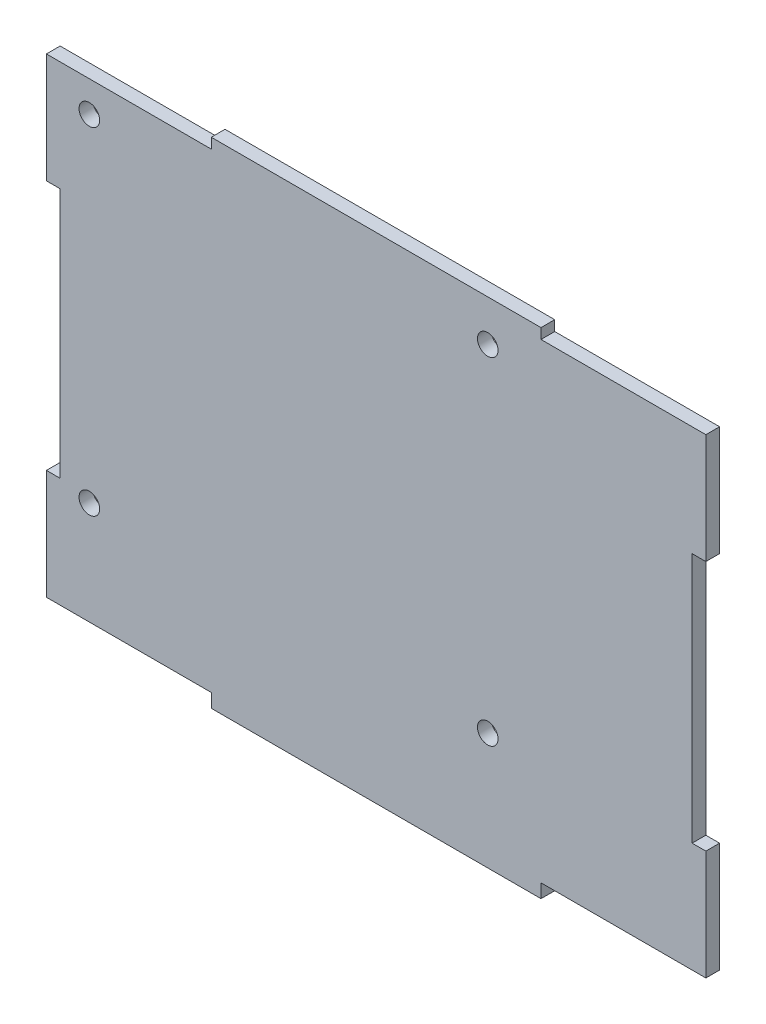
ISO-10303-21;
HEADER;
FILE_DESCRIPTION(('STEP AP214'),'2;1');
FILE_NAME('part.step','',(''),(''),'','','');
FILE_SCHEMA(('AUTOMOTIVE_DESIGN { 1 0 10303 214 1 1 1 1 }'));
ENDSEC;
DATA;
#1=APPLICATION_CONTEXT('core data for automotive mechanical design processes');
#2=APPLICATION_PROTOCOL_DEFINITION('international standard','automotive_design',2000,#1);
#3=PRODUCT_CONTEXT('',#1,'mechanical');
#4=PRODUCT('Part','Part','',(#3));
#5=PRODUCT_RELATED_PRODUCT_CATEGORY('part','',(#4));
#6=PRODUCT_DEFINITION_FORMATION('','',#4);
#7=PRODUCT_DEFINITION_CONTEXT('part definition',#1,'design');
#8=PRODUCT_DEFINITION('design','',#6,#7);
#9=PRODUCT_DEFINITION_SHAPE('','',#8);
#10=(LENGTH_UNIT() NAMED_UNIT(*) SI_UNIT(.MILLI.,.METRE.));
#11=(NAMED_UNIT(*) PLANE_ANGLE_UNIT() SI_UNIT($,.RADIAN.));
#12=(NAMED_UNIT(*) SI_UNIT($,.STERADIAN.) SOLID_ANGLE_UNIT());
#13=UNCERTAINTY_MEASURE_WITH_UNIT(LENGTH_MEASURE(1.E-05),#10,'distance_accuracy_value','');
#14=(GEOMETRIC_REPRESENTATION_CONTEXT(3) GLOBAL_UNCERTAINTY_ASSIGNED_CONTEXT((#13)) GLOBAL_UNIT_ASSIGNED_CONTEXT((#10,
#11,#12)) REPRESENTATION_CONTEXT('',''));
#15=CARTESIAN_POINT('',(0.,0.,0.));
#16=DIRECTION('',(0.,0.,1.));
#17=DIRECTION('',(1.,0.,0.));
#18=AXIS2_PLACEMENT_3D('',#15,#16,#17);
#19=CARTESIAN_POINT('',(50.0272444260496,49.5737704918033,2.));
#20=DIRECTION('',(-1.,0.,0.));
#21=DIRECTION('',(0.,0.,1.));
#22=AXIS2_PLACEMENT_3D('',#19,#20,#21);
#23=PLANE('',#22);
#24=DIRECTION('',(0.,1.,0.));
#25=VECTOR('',#24,1.);
#26=CARTESIAN_POINT('',(50.0272444260496,49.5737704918033,2.));
#27=LINE('',#26,#25);
#28=CARTESIAN_POINT('',(50.0272444260505,32.0737704918033,2.));
#29=VERTEX_POINT('',#28);
#30=CARTESIAN_POINT('',(50.02724442605,48.0737704918033,2.));
#31=VERTEX_POINT('',#30);
#32=EDGE_CURVE('E197',#29,#31,#27,.T.);
#33=ORIENTED_EDGE('',*,*,#32,.F.);
#34=DIRECTION('',(0.,0.,-1.));
#35=VECTOR('',#34,1.);
#36=CARTESIAN_POINT('',(50.0272444260505,32.0737704918033,2.));
#37=LINE('',#36,#35);
#38=CARTESIAN_POINT('',(50.0272444260505,32.0737704918033,0.));
#39=VERTEX_POINT('',#38);
#40=EDGE_CURVE('E334',#29,#39,#37,.T.);
#41=ORIENTED_EDGE('',*,*,#40,.T.);
#42=DIRECTION('',(0.,1.,0.));
#43=VECTOR('',#42,1.);
#44=CARTESIAN_POINT('',(50.0272444260496,49.5737704918033,0.));
#45=LINE('',#44,#43);
#46=CARTESIAN_POINT('',(50.0272444260496,48.0737704918033,0.));
#47=VERTEX_POINT('',#46);
#48=EDGE_CURVE('E212',#39,#47,#45,.T.);
#49=ORIENTED_EDGE('',*,*,#48,.T.);
#50=DIRECTION('',(0.,0.,-1.));
#51=VECTOR('',#50,1.);
#52=CARTESIAN_POINT('',(50.02724442605,48.0737704918033,2.));
#53=LINE('',#52,#51);
#54=EDGE_CURVE('E288',#31,#47,#53,.T.);
#55=ORIENTED_EDGE('',*,*,#54,.F.);
#56=EDGE_LOOP('',(#33,#41,#49,#55));
#57=FACE_BOUND('',#56,.T.);
#58=ADVANCED_FACE('F33',(#57),#23,.F.);
#59=CARTESIAN_POINT('',(-45.9727555739504,49.5737704918033,2.));
#60=DIRECTION('',(1.,0.,0.));
#61=DIRECTION('',(0.,1.,0.));
#62=AXIS2_PLACEMENT_3D('',#59,#60,#61);
#63=PLANE('',#62);
#64=DIRECTION('',(0.,-1.,0.));
#65=VECTOR('',#64,1.);
#66=CARTESIAN_POINT('',(-45.9727555739504,49.5737704918033,2.));
#67=LINE('',#66,#65);
#68=CARTESIAN_POINT('',(-45.9727555739495,-4.4262295081967,2.));
#69=VERTEX_POINT('',#68);
#70=CARTESIAN_POINT('',(-45.9727555739504,-20.4262295081967,2.));
#71=VERTEX_POINT('',#70);
#72=EDGE_CURVE('E215',#69,#71,#67,.T.);
#73=ORIENTED_EDGE('',*,*,#72,.F.);
#74=DIRECTION('',(0.,0.,-1.));
#75=VECTOR('',#74,1.);
#76=CARTESIAN_POINT('',(-45.9727555739495,-4.4262295081967,2.));
#77=LINE('',#76,#75);
#78=CARTESIAN_POINT('',(-45.9727555739495,-4.4262295081967,0.));
#79=VERTEX_POINT('',#78);
#80=EDGE_CURVE('E301',#69,#79,#77,.T.);
#81=ORIENTED_EDGE('',*,*,#80,.T.);
#82=DIRECTION('',(0.,-1.,0.));
#83=VECTOR('',#82,1.);
#84=CARTESIAN_POINT('',(-45.9727555739504,49.5737704918033,0.));
#85=LINE('',#84,#83);
#86=CARTESIAN_POINT('',(-45.9727555739504,-20.4262295081967,0.));
#87=VERTEX_POINT('',#86);
#88=EDGE_CURVE('E209',#79,#87,#85,.T.);
#89=ORIENTED_EDGE('',*,*,#88,.T.);
#90=DIRECTION('',(0.,0.,-1.));
#91=VECTOR('',#90,1.);
#92=CARTESIAN_POINT('',(-45.9727555739504,-20.4262295081967,2.));
#93=LINE('',#92,#91);
#94=EDGE_CURVE('E268',#71,#87,#93,.T.);
#95=ORIENTED_EDGE('',*,*,#94,.F.);
#96=EDGE_LOOP('',(#73,#81,#89,#95));
#97=FACE_BOUND('',#96,.T.);
#98=ADVANCED_FACE('F395',(#97),#63,.F.);
#99=CARTESIAN_POINT('',(-45.97275557395,48.0737704918033,0.));
#100=VERTEX_POINT('',#99);
#101=CARTESIAN_POINT('',(-45.9727555739504,32.0737704918033,0.));
#102=VERTEX_POINT('',#101);
#103=EDGE_CURVE('E205',#100,#102,#85,.T.);
#104=ORIENTED_EDGE('',*,*,#103,.T.);
#105=DIRECTION('',(0.,0.,-1.));
#106=VECTOR('',#105,1.);
#107=CARTESIAN_POINT('',(-45.9727555739495,32.0737704918033,2.));
#108=LINE('',#107,#106);
#109=CARTESIAN_POINT('',(-45.9727555739495,32.0737704918033,2.));
#110=VERTEX_POINT('',#109);
#111=EDGE_CURVE('E56',#110,#102,#108,.T.);
#112=ORIENTED_EDGE('',*,*,#111,.F.);
#113=CARTESIAN_POINT('',(-45.97275557395,48.0737704918033,2.));
#114=VERTEX_POINT('',#113);
#115=EDGE_CURVE('E220',#114,#110,#67,.T.);
#116=ORIENTED_EDGE('',*,*,#115,.F.);
#117=DIRECTION('',(0.,0.,-1.));
#118=VECTOR('',#117,1.);
#119=CARTESIAN_POINT('',(-45.97275557395,48.0737704918033,2.));
#120=LINE('',#119,#118);
#121=EDGE_CURVE('E287',#114,#100,#120,.T.);
#122=ORIENTED_EDGE('',*,*,#121,.T.);
#123=EDGE_LOOP('',(#104,#112,#116,#122));
#124=FACE_BOUND('',#123,.T.);
#125=ADVANCED_FACE('F35',(#124),#63,.F.);
#126=CARTESIAN_POINT('',(-45.9727555739504,-22.4262295081967,2.));
#127=DIRECTION('',(0.,1.,0.));
#128=DIRECTION('',(0.,0.,1.));
#129=AXIS2_PLACEMENT_3D('',#126,#127,#128);
#130=PLANE('',#129);
#131=DIRECTION('',(1.,0.,0.));
#132=VECTOR('',#131,1.);
#133=CARTESIAN_POINT('',(-45.9727555739504,-22.4262295081967,2.));
#134=LINE('',#133,#132);
#135=CARTESIAN_POINT('',(-21.9727555739504,-22.4262295081967,2.));
#136=VERTEX_POINT('',#135);
#137=CARTESIAN_POINT('',(26.0272444260496,-22.4262295081967,2.));
#138=VERTEX_POINT('',#137);
#139=EDGE_CURVE('E201',#136,#138,#134,.T.);
#140=ORIENTED_EDGE('',*,*,#139,.F.);
#141=DIRECTION('',(0.,0.,-1.));
#142=VECTOR('',#141,1.);
#143=CARTESIAN_POINT('',(-21.9727555739504,-22.4262295081967,2.));
#144=LINE('',#143,#142);
#145=CARTESIAN_POINT('',(-21.9727555739504,-22.4262295081967,0.));
#146=VERTEX_POINT('',#145);
#147=EDGE_CURVE('E249',#136,#146,#144,.T.);
#148=ORIENTED_EDGE('',*,*,#147,.T.);
#149=DIRECTION('',(1.,0.,0.));
#150=VECTOR('',#149,1.);
#151=CARTESIAN_POINT('',(-45.9727555739504,-22.4262295081967,0.));
#152=LINE('',#151,#150);
#153=CARTESIAN_POINT('',(26.0272444260496,-22.4262295081967,0.));
#154=VERTEX_POINT('',#153);
#155=EDGE_CURVE('E208',#146,#154,#152,.T.);
#156=ORIENTED_EDGE('',*,*,#155,.T.);
#157=DIRECTION('',(0.,0.,-1.));
#158=VECTOR('',#157,1.);
#159=CARTESIAN_POINT('',(26.0272444260496,-22.4262295081967,2.));
#160=LINE('',#159,#158);
#161=EDGE_CURVE('E252',#138,#154,#160,.T.);
#162=ORIENTED_EDGE('',*,*,#161,.F.);
#163=EDGE_LOOP('',(#140,#148,#156,#162));
#164=FACE_BOUND('',#163,.T.);
#165=ADVANCED_FACE('F408',(#164),#130,.F.);
#166=CARTESIAN_POINT('',(50.0272444260496,-20.4262295081967,0.));
#167=VERTEX_POINT('',#166);
#168=CARTESIAN_POINT('',(50.0272444260496,-4.4262295081967,0.));
#169=VERTEX_POINT('',#168);
#170=EDGE_CURVE('E187',#167,#169,#45,.T.);
#171=ORIENTED_EDGE('',*,*,#170,.T.);
#172=DIRECTION('',(0.,0.,-1.));
#173=VECTOR('',#172,1.);
#174=CARTESIAN_POINT('',(50.0272444260505,-4.4262295081967,2.));
#175=LINE('',#174,#173);
#176=CARTESIAN_POINT('',(50.0272444260505,-4.4262295081967,2.));
#177=VERTEX_POINT('',#176);
#178=EDGE_CURVE('E48',#177,#169,#175,.T.);
#179=ORIENTED_EDGE('',*,*,#178,.F.);
#180=CARTESIAN_POINT('',(50.0272444260496,-20.4262295081967,2.));
#181=VERTEX_POINT('',#180);
#182=EDGE_CURVE('E185',#181,#177,#27,.T.);
#183=ORIENTED_EDGE('',*,*,#182,.F.);
#184=DIRECTION('',(0.,0.,-1.));
#185=VECTOR('',#184,1.);
#186=CARTESIAN_POINT('',(50.0272444260496,-20.4262295081967,2.));
#187=LINE('',#186,#185);
#188=EDGE_CURVE('E256',#181,#167,#187,.T.);
#189=ORIENTED_EDGE('',*,*,#188,.T.);
#190=EDGE_LOOP('',(#171,#179,#183,#189));
#191=FACE_BOUND('',#190,.T.);
#192=ADVANCED_FACE('F183',(#191),#23,.F.);
#193=CARTESIAN_POINT('',(-45.9727555739504,49.5737704918033,2.));
#194=DIRECTION('',(0.,-1.,0.));
#195=DIRECTION('',(0.,0.,-1.));
#196=AXIS2_PLACEMENT_3D('',#193,#194,#195);
#197=PLANE('',#196);
#198=DIRECTION('',(-1.,0.,0.));
#199=VECTOR('',#198,1.);
#200=CARTESIAN_POINT('',(-45.9727555739504,49.5737704918033,0.));
#201=LINE('',#200,#199);
#202=CARTESIAN_POINT('',(26.02724442605,49.5737704918033,0.));
#203=VERTEX_POINT('',#202);
#204=CARTESIAN_POINT('',(-21.97275557395,49.5737704918033,0.));
#205=VERTEX_POINT('',#204);
#206=EDGE_CURVE('E213',#203,#205,#201,.T.);
#207=ORIENTED_EDGE('',*,*,#206,.T.);
#208=DIRECTION('',(0.,0.,1.));
#209=VECTOR('',#208,1.);
#210=CARTESIAN_POINT('',(-21.97275557395,49.5737704918033,2.));
#211=LINE('',#210,#209);
#212=CARTESIAN_POINT('',(-21.97275557395,49.5737704918033,2.));
#213=VERTEX_POINT('',#212);
#214=EDGE_CURVE('E265',#205,#213,#211,.T.);
#215=ORIENTED_EDGE('',*,*,#214,.T.);
#216=DIRECTION('',(-1.,0.,0.));
#217=VECTOR('',#216,1.);
#218=CARTESIAN_POINT('',(-45.9727555739504,49.5737704918033,2.));
#219=LINE('',#218,#217);
#220=CARTESIAN_POINT('',(26.02724442605,49.5737704918033,2.));
#221=VERTEX_POINT('',#220);
#222=EDGE_CURVE('E41',#221,#213,#219,.T.);
#223=ORIENTED_EDGE('',*,*,#222,.F.);
#224=DIRECTION('',(0.,0.,-1.));
#225=VECTOR('',#224,1.);
#226=CARTESIAN_POINT('',(26.02724442605,49.5737704918033,2.));
#227=LINE('',#226,#225);
#228=EDGE_CURVE('E285',#221,#203,#227,.T.);
#229=ORIENTED_EDGE('',*,*,#228,.T.);
#230=EDGE_LOOP('',(#207,#215,#223,#229));
#231=FACE_BOUND('',#230,.T.);
#232=ADVANCED_FACE('F374',(#231),#197,.F.);
#233=CARTESIAN_POINT('',(0.,0.,2.));
#234=DIRECTION('',(0.,0.,1.));
#235=DIRECTION('',(1.,0.,0.));
#236=AXIS2_PLACEMENT_3D('',#233,#234,#235);
#237=PLANE('',#236);
#238=DIRECTION('',(1.,0.,0.));
#239=VECTOR('',#238,1.);
#240=CARTESIAN_POINT('',(50.0272444260505,32.0737704918033,2.));
#241=LINE('',#240,#239);
#242=CARTESIAN_POINT('',(48.0272444260505,32.0737704918033,2.));
#243=VERTEX_POINT('',#242);
#244=EDGE_CURVE('E188',#243,#29,#241,.T.);
#245=ORIENTED_EDGE('',*,*,#244,.T.);
#246=ORIENTED_EDGE('',*,*,#32,.T.);
#247=DIRECTION('',(-1.,0.,0.));
#248=VECTOR('',#247,1.);
#249=CARTESIAN_POINT('',(50.02724442605,48.0737704918033,2.));
#250=LINE('',#249,#248);
#251=CARTESIAN_POINT('',(26.02724442605,48.0737704918033,2.));
#252=VERTEX_POINT('',#251);
#253=EDGE_CURVE('E297',#31,#252,#250,.T.);
#254=ORIENTED_EDGE('',*,*,#253,.T.);
#255=DIRECTION('',(0.,1.,0.));
#256=VECTOR('',#255,1.);
#257=CARTESIAN_POINT('',(26.02724442605,50.0737704918033,2.));
#258=LINE('',#257,#256);
#259=EDGE_CURVE('E292',#252,#221,#258,.T.);
#260=ORIENTED_EDGE('',*,*,#259,.T.);
#261=ORIENTED_EDGE('',*,*,#222,.T.);
#262=DIRECTION('',(0.,-1.,0.));
#263=VECTOR('',#262,1.);
#264=CARTESIAN_POINT('',(-21.97275557395,50.0737704918033,2.));
#265=LINE('',#264,#263);
#266=CARTESIAN_POINT('',(-21.97275557395,48.0737704918033,2.));
#267=VERTEX_POINT('',#266);
#268=EDGE_CURVE('E313',#213,#267,#265,.T.);
#269=ORIENTED_EDGE('',*,*,#268,.T.);
#270=DIRECTION('',(-1.,0.,0.));
#271=VECTOR('',#270,1.);
#272=CARTESIAN_POINT('',(-45.97275557395,48.0737704918033,2.));
#273=LINE('',#272,#271);
#274=EDGE_CURVE('E309',#267,#114,#273,.T.);
#275=ORIENTED_EDGE('',*,*,#274,.T.);
#276=ORIENTED_EDGE('',*,*,#115,.T.);
#277=DIRECTION('',(1.,0.,0.));
#278=VECTOR('',#277,1.);
#279=CARTESIAN_POINT('',(-45.9727555739495,32.0737704918033,2.));
#280=LINE('',#279,#278);
#281=CARTESIAN_POINT('',(-43.9727555739495,32.0737704918033,2.));
#282=VERTEX_POINT('',#281);
#283=EDGE_CURVE('E328',#110,#282,#280,.T.);
#284=ORIENTED_EDGE('',*,*,#283,.T.);
#285=DIRECTION('',(0.,-1.,0.));
#286=VECTOR('',#285,1.);
#287=CARTESIAN_POINT('',(-43.9727555739495,-4.4262295081967,2.));
#288=LINE('',#287,#286);
#289=CARTESIAN_POINT('',(-43.9727555739495,-4.4262295081967,2.));
#290=VERTEX_POINT('',#289);
#291=EDGE_CURVE('E336',#282,#290,#288,.T.);
#292=ORIENTED_EDGE('',*,*,#291,.T.);
#293=DIRECTION('',(-1.,0.,0.));
#294=VECTOR('',#293,1.);
#295=CARTESIAN_POINT('',(-45.9727555739495,-4.4262295081967,2.));
#296=LINE('',#295,#294);
#297=EDGE_CURVE('E320',#290,#69,#296,.T.);
#298=ORIENTED_EDGE('',*,*,#297,.T.);
#299=ORIENTED_EDGE('',*,*,#72,.T.);
#300=DIRECTION('',(1.,0.,0.));
#301=VECTOR('',#300,1.);
#302=CARTESIAN_POINT('',(-45.9727555739504,-20.4262295081967,2.));
#303=LINE('',#302,#301);
#304=CARTESIAN_POINT('',(-21.9727555739504,-20.4262295081967,2.));
#305=VERTEX_POINT('',#304);
#306=EDGE_CURVE('E278',#71,#305,#303,.T.);
#307=ORIENTED_EDGE('',*,*,#306,.T.);
#308=DIRECTION('',(0.,-1.,0.));
#309=VECTOR('',#308,1.);
#310=CARTESIAN_POINT('',(-21.9727555739504,-22.4262295081967,2.));
#311=LINE('',#310,#309);
#312=EDGE_CURVE('E272',#305,#136,#311,.T.);
#313=ORIENTED_EDGE('',*,*,#312,.T.);
#314=ORIENTED_EDGE('',*,*,#139,.T.);
#315=DIRECTION('',(0.,1.,0.));
#316=VECTOR('',#315,1.);
#317=CARTESIAN_POINT('',(26.0272444260496,-22.4262295081967,2.));
#318=LINE('',#317,#316);
#319=CARTESIAN_POINT('',(26.0272444260496,-20.4262295081967,2.));
#320=VERTEX_POINT('',#319);
#321=EDGE_CURVE('E261',#138,#320,#318,.T.);
#322=ORIENTED_EDGE('',*,*,#321,.T.);
#323=DIRECTION('',(1.,0.,0.));
#324=VECTOR('',#323,1.);
#325=CARTESIAN_POINT('',(50.0272444260496,-20.4262295081967,2.));
#326=LINE('',#325,#324);
#327=EDGE_CURVE('E196',#320,#181,#326,.T.);
#328=ORIENTED_EDGE('',*,*,#327,.T.);
#329=ORIENTED_EDGE('',*,*,#182,.T.);
#330=DIRECTION('',(-1.,0.,0.));
#331=VECTOR('',#330,1.);
#332=CARTESIAN_POINT('',(50.0272444260505,-4.4262295081967,2.));
#333=LINE('',#332,#331);
#334=CARTESIAN_POINT('',(48.0272444260505,-4.4262295081967,2.));
#335=VERTEX_POINT('',#334);
#336=EDGE_CURVE('E170',#177,#335,#333,.T.);
#337=ORIENTED_EDGE('',*,*,#336,.T.);
#338=DIRECTION('',(0.,1.,0.));
#339=VECTOR('',#338,1.);
#340=CARTESIAN_POINT('',(48.0272444260505,-4.4262295081967,2.));
#341=LINE('',#340,#339);
#342=EDGE_CURVE('E177',#335,#243,#341,.T.);
#343=ORIENTED_EDGE('',*,*,#342,.T.);
#344=EDGE_LOOP('',(#245,#246,#254,#260,#261,#269,#275,#276,#284,#292,#298,#299,#307,#313,#314,
#322,#328,#329,#337,#343));
#345=FACE_BOUND('',#344,.T.);
#346=CARTESIAN_POINT('',(18.2772444260498,43.5737704918031,2.));
#347=DIRECTION('',(0.,0.,-1.));
#348=DIRECTION('',(-1.,0.,0.));
#349=AXIS2_PLACEMENT_3D('',#346,#347,#348);
#350=CIRCLE('',#349,1.5);
#351=CARTESIAN_POINT('',(16.7772444260498,43.5737704918031,2.));
#352=VERTEX_POINT('',#351);
#353=EDGE_CURVE('E231',#352,#352,#350,.T.);
#354=ORIENTED_EDGE('',*,*,#353,.T.);
#355=EDGE_LOOP('',(#354));
#356=FACE_BOUND('',#355,.T.);
#357=CARTESIAN_POINT('',(-39.7227555739502,-5.42622950819689,2.));
#358=DIRECTION('',(0.,0.,-1.));
#359=DIRECTION('',(-1.,0.,0.));
#360=AXIS2_PLACEMENT_3D('',#357,#358,#359);
#361=CIRCLE('',#360,1.5);
#362=CARTESIAN_POINT('',(-41.2227555739502,-5.42622950819689,2.));
#363=VERTEX_POINT('',#362);
#364=EDGE_CURVE('E237',#363,#363,#361,.T.);
#365=ORIENTED_EDGE('',*,*,#364,.T.);
#366=EDGE_LOOP('',(#365));
#367=FACE_BOUND('',#366,.T.);
#368=CARTESIAN_POINT('',(-39.7227555739502,43.5737704918031,2.));
#369=DIRECTION('',(0.,0.,-1.));
#370=DIRECTION('',(-1.,0.,0.));
#371=AXIS2_PLACEMENT_3D('',#368,#369,#370);
#372=CIRCLE('',#371,1.5);
#373=CARTESIAN_POINT('',(-41.2227555739502,43.5737704918031,2.));
#374=VERTEX_POINT('',#373);
#375=EDGE_CURVE('E238',#374,#374,#372,.T.);
#376=ORIENTED_EDGE('',*,*,#375,.T.);
#377=EDGE_LOOP('',(#376));
#378=FACE_BOUND('',#377,.T.);
#379=CARTESIAN_POINT('',(18.2772444260498,-5.42622950819689,2.));
#380=DIRECTION('',(0.,0.,-1.));
#381=DIRECTION('',(-1.,0.,0.));
#382=AXIS2_PLACEMENT_3D('',#379,#380,#381);
#383=CIRCLE('',#382,1.5);
#384=CARTESIAN_POINT('',(16.7772444260498,-5.42622950819689,2.));
#385=VERTEX_POINT('',#384);
#386=EDGE_CURVE('E230',#385,#385,#383,.T.);
#387=ORIENTED_EDGE('',*,*,#386,.T.);
#388=EDGE_LOOP('',(#387));
#389=FACE_BOUND('',#388,.T.);
#390=ADVANCED_FACE('F192',(#345,#356,#367,#378,#389),#237,.T.);
#391=CARTESIAN_POINT('',(0.,0.,0.));
#392=DIRECTION('',(0.,0.,1.));
#393=DIRECTION('',(1.,0.,0.));
#394=AXIS2_PLACEMENT_3D('',#391,#392,#393);
#395=PLANE('',#394);
#396=CARTESIAN_POINT('',(18.2772444260498,43.5737704918031,0.));
#397=DIRECTION('',(0.,0.,-1.));
#398=DIRECTION('',(-1.,0.,0.));
#399=AXIS2_PLACEMENT_3D('',#396,#397,#398);
#400=CIRCLE('',#399,1.5);
#401=CARTESIAN_POINT('',(16.7772444260498,43.5737704918031,0.));
#402=VERTEX_POINT('',#401);
#403=EDGE_CURVE('E241',#402,#402,#400,.T.);
#404=ORIENTED_EDGE('',*,*,#403,.F.);
#405=EDGE_LOOP('',(#404));
#406=FACE_BOUND('',#405,.T.);
#407=CARTESIAN_POINT('',(-39.7227555739502,-5.42622950819689,0.));
#408=DIRECTION('',(0.,0.,-1.));
#409=DIRECTION('',(-1.,0.,0.));
#410=AXIS2_PLACEMENT_3D('',#407,#408,#409);
#411=CIRCLE('',#410,1.5);
#412=CARTESIAN_POINT('',(-41.2227555739502,-5.42622950819689,0.));
#413=VERTEX_POINT('',#412);
#414=EDGE_CURVE('E234',#413,#413,#411,.T.);
#415=ORIENTED_EDGE('',*,*,#414,.F.);
#416=EDGE_LOOP('',(#415));
#417=FACE_BOUND('',#416,.T.);
#418=CARTESIAN_POINT('',(-39.7227555739502,43.5737704918031,0.));
#419=DIRECTION('',(0.,0.,-1.));
#420=DIRECTION('',(-1.,0.,0.));
#421=AXIS2_PLACEMENT_3D('',#418,#419,#420);
#422=CIRCLE('',#421,1.5);
#423=CARTESIAN_POINT('',(-41.2227555739502,43.5737704918031,0.));
#424=VERTEX_POINT('',#423);
#425=EDGE_CURVE('E246',#424,#424,#422,.T.);
#426=ORIENTED_EDGE('',*,*,#425,.F.);
#427=EDGE_LOOP('',(#426));
#428=FACE_BOUND('',#427,.T.);
#429=CARTESIAN_POINT('',(18.2772444260498,-5.42622950819689,0.));
#430=DIRECTION('',(0.,0.,-1.));
#431=DIRECTION('',(-1.,0.,0.));
#432=AXIS2_PLACEMENT_3D('',#429,#430,#431);
#433=CIRCLE('',#432,1.5);
#434=CARTESIAN_POINT('',(16.7772444260498,-5.42622950819689,0.));
#435=VERTEX_POINT('',#434);
#436=EDGE_CURVE('E227',#435,#435,#433,.T.);
#437=ORIENTED_EDGE('',*,*,#436,.F.);
#438=EDGE_LOOP('',(#437));
#439=FACE_BOUND('',#438,.T.);
#440=ORIENTED_EDGE('',*,*,#48,.F.);
#441=DIRECTION('',(1.,0.,0.));
#442=VECTOR('',#441,1.);
#443=CARTESIAN_POINT('',(50.0272444260505,32.0737704918033,0.));
#444=LINE('',#443,#442);
#445=CARTESIAN_POINT('',(48.0272444260505,32.0737704918033,0.));
#446=VERTEX_POINT('',#445);
#447=EDGE_CURVE('E178',#446,#39,#444,.T.);
#448=ORIENTED_EDGE('',*,*,#447,.F.);
#449=DIRECTION('',(0.,1.,0.));
#450=VECTOR('',#449,1.);
#451=CARTESIAN_POINT('',(48.0272444260505,-4.4262295081967,0.));
#452=LINE('',#451,#450);
#453=CARTESIAN_POINT('',(48.0272444260505,-4.4262295081967,0.));
#454=VERTEX_POINT('',#453);
#455=EDGE_CURVE('E347',#454,#446,#452,.T.);
#456=ORIENTED_EDGE('',*,*,#455,.F.);
#457=DIRECTION('',(-1.,0.,0.));
#458=VECTOR('',#457,1.);
#459=CARTESIAN_POINT('',(50.0272444260505,-4.4262295081967,0.));
#460=LINE('',#459,#458);
#461=EDGE_CURVE('E350',#169,#454,#460,.T.);
#462=ORIENTED_EDGE('',*,*,#461,.F.);
#463=ORIENTED_EDGE('',*,*,#170,.F.);
#464=DIRECTION('',(1.,0.,0.));
#465=VECTOR('',#464,1.);
#466=CARTESIAN_POINT('',(50.0272444260496,-20.4262295081967,0.));
#467=LINE('',#466,#465);
#468=CARTESIAN_POINT('',(26.0272444260496,-20.4262295081967,0.));
#469=VERTEX_POINT('',#468);
#470=EDGE_CURVE('E259',#469,#167,#467,.T.);
#471=ORIENTED_EDGE('',*,*,#470,.F.);
#472=DIRECTION('',(0.,1.,0.));
#473=VECTOR('',#472,1.);
#474=CARTESIAN_POINT('',(26.0272444260496,-22.4262295081967,0.));
#475=LINE('',#474,#473);
#476=EDGE_CURVE('E262',#154,#469,#475,.T.);
#477=ORIENTED_EDGE('',*,*,#476,.F.);
#478=ORIENTED_EDGE('',*,*,#155,.F.);
#479=DIRECTION('',(0.,-1.,0.));
#480=VECTOR('',#479,1.);
#481=CARTESIAN_POINT('',(-21.9727555739504,-22.4262295081967,0.));
#482=LINE('',#481,#480);
#483=CARTESIAN_POINT('',(-21.9727555739504,-20.4262295081967,0.));
#484=VERTEX_POINT('',#483);
#485=EDGE_CURVE('E276',#484,#146,#482,.T.);
#486=ORIENTED_EDGE('',*,*,#485,.F.);
#487=DIRECTION('',(1.,0.,0.));
#488=VECTOR('',#487,1.);
#489=CARTESIAN_POINT('',(-45.9727555739504,-20.4262295081967,0.));
#490=LINE('',#489,#488);
#491=EDGE_CURVE('E258',#87,#484,#490,.T.);
#492=ORIENTED_EDGE('',*,*,#491,.F.);
#493=ORIENTED_EDGE('',*,*,#88,.F.);
#494=DIRECTION('',(-1.,0.,0.));
#495=VECTOR('',#494,1.);
#496=CARTESIAN_POINT('',(-45.9727555739495,-4.4262295081967,0.));
#497=LINE('',#496,#495);
#498=CARTESIAN_POINT('',(-43.9727555739495,-4.4262295081967,0.));
#499=VERTEX_POINT('',#498);
#500=EDGE_CURVE('E326',#499,#79,#497,.T.);
#501=ORIENTED_EDGE('',*,*,#500,.F.);
#502=DIRECTION('',(0.,-1.,0.));
#503=VECTOR('',#502,1.);
#504=CARTESIAN_POINT('',(-43.9727555739495,-4.4262295081967,0.));
#505=LINE('',#504,#503);
#506=CARTESIAN_POINT('',(-43.9727555739495,32.0737704918033,0.));
#507=VERTEX_POINT('',#506);
#508=EDGE_CURVE('E329',#507,#499,#505,.T.);
#509=ORIENTED_EDGE('',*,*,#508,.F.);
#510=DIRECTION('',(1.,0.,0.));
#511=VECTOR('',#510,1.);
#512=CARTESIAN_POINT('',(-45.9727555739495,32.0737704918033,0.));
#513=LINE('',#512,#511);
#514=EDGE_CURVE('E332',#102,#507,#513,.T.);
#515=ORIENTED_EDGE('',*,*,#514,.F.);
#516=ORIENTED_EDGE('',*,*,#103,.F.);
#517=DIRECTION('',(-1.,0.,0.));
#518=VECTOR('',#517,1.);
#519=CARTESIAN_POINT('',(-45.97275557395,48.0737704918033,0.));
#520=LINE('',#519,#518);
#521=CARTESIAN_POINT('',(-21.97275557395,48.0737704918033,0.));
#522=VERTEX_POINT('',#521);
#523=EDGE_CURVE('E294',#522,#100,#520,.T.);
#524=ORIENTED_EDGE('',*,*,#523,.F.);
#525=DIRECTION('',(0.,1.,0.));
#526=VECTOR('',#525,1.);
#527=CARTESIAN_POINT('',(-21.97275557395,0.,0.));
#528=LINE('',#527,#526);
#529=EDGE_CURVE('E11',#522,#205,#528,.T.);
#530=ORIENTED_EDGE('',*,*,#529,.T.);
#531=ORIENTED_EDGE('',*,*,#206,.F.);
#532=DIRECTION('',(0.,1.,0.));
#533=VECTOR('',#532,1.);
#534=CARTESIAN_POINT('',(26.02724442605,50.0737704918033,0.));
#535=LINE('',#534,#533);
#536=CARTESIAN_POINT('',(26.02724442605,48.0737704918033,0.));
#537=VERTEX_POINT('',#536);
#538=EDGE_CURVE('E295',#537,#203,#535,.T.);
#539=ORIENTED_EDGE('',*,*,#538,.F.);
#540=DIRECTION('',(-1.,0.,0.));
#541=VECTOR('',#540,1.);
#542=CARTESIAN_POINT('',(50.02724442605,48.0737704918033,0.));
#543=LINE('',#542,#541);
#544=EDGE_CURVE('E298',#47,#537,#543,.T.);
#545=ORIENTED_EDGE('',*,*,#544,.F.);
#546=EDGE_LOOP('',(#440,#448,#456,#462,#463,#471,#477,#478,#486,#492,#493,#501,#509,#515,#516,
#524,#530,#531,#539,#545));
#547=FACE_BOUND('',#546,.T.);
#548=ADVANCED_FACE('F366',(#406,#417,#428,#439,#547),#395,.F.);
#549=CARTESIAN_POINT('',(18.2772444260498,-5.42622950819689,2.));
#550=DIRECTION('',(0.,0.,-1.));
#551=DIRECTION('',(-1.,0.,0.));
#552=AXIS2_PLACEMENT_3D('',#549,#550,#551);
#553=CYLINDRICAL_SURFACE('',#552,1.5);
#554=ORIENTED_EDGE('',*,*,#386,.F.);
#555=EDGE_LOOP('',(#554));
#556=FACE_BOUND('',#555,.T.);
#557=ORIENTED_EDGE('',*,*,#436,.T.);
#558=EDGE_LOOP('',(#557));
#559=FACE_BOUND('',#558,.T.);
#560=ADVANCED_FACE('F572',(#556,#559),#553,.F.);
#561=CARTESIAN_POINT('',(-39.7227555739502,43.5737704918031,2.));
#562=DIRECTION('',(0.,0.,-1.));
#563=DIRECTION('',(-1.,0.,0.));
#564=AXIS2_PLACEMENT_3D('',#561,#562,#563);
#565=CYLINDRICAL_SURFACE('',#564,1.5);
#566=ORIENTED_EDGE('',*,*,#375,.F.);
#567=EDGE_LOOP('',(#566));
#568=FACE_BOUND('',#567,.T.);
#569=ORIENTED_EDGE('',*,*,#425,.T.);
#570=EDGE_LOOP('',(#569));
#571=FACE_BOUND('',#570,.T.);
#572=ADVANCED_FACE('F563',(#568,#571),#565,.F.);
#573=CARTESIAN_POINT('',(-39.7227555739502,-5.42622950819689,2.));
#574=DIRECTION('',(0.,0.,-1.));
#575=DIRECTION('',(-1.,0.,0.));
#576=AXIS2_PLACEMENT_3D('',#573,#574,#575);
#577=CYLINDRICAL_SURFACE('',#576,1.5);
#578=ORIENTED_EDGE('',*,*,#364,.F.);
#579=EDGE_LOOP('',(#578));
#580=FACE_BOUND('',#579,.T.);
#581=ORIENTED_EDGE('',*,*,#414,.T.);
#582=EDGE_LOOP('',(#581));
#583=FACE_BOUND('',#582,.T.);
#584=ADVANCED_FACE('F424',(#580,#583),#577,.F.);
#585=CARTESIAN_POINT('',(18.2772444260498,43.5737704918031,2.));
#586=DIRECTION('',(0.,0.,-1.));
#587=DIRECTION('',(-1.,0.,0.));
#588=AXIS2_PLACEMENT_3D('',#585,#586,#587);
#589=CYLINDRICAL_SURFACE('',#588,1.5);
#590=ORIENTED_EDGE('',*,*,#353,.F.);
#591=EDGE_LOOP('',(#590));
#592=FACE_BOUND('',#591,.T.);
#593=ORIENTED_EDGE('',*,*,#403,.T.);
#594=EDGE_LOOP('',(#593));
#595=FACE_BOUND('',#594,.T.);
#596=ADVANCED_FACE('F417',(#592,#595),#589,.F.);
#597=CARTESIAN_POINT('',(50.0272444260496,-20.4262295081967,2.));
#598=DIRECTION('',(0.,1.,0.));
#599=DIRECTION('',(0.,0.,1.));
#600=AXIS2_PLACEMENT_3D('',#597,#598,#599);
#601=PLANE('',#600);
#602=ORIENTED_EDGE('',*,*,#470,.T.);
#603=ORIENTED_EDGE('',*,*,#188,.F.);
#604=ORIENTED_EDGE('',*,*,#327,.F.);
#605=DIRECTION('',(0.,0.,-1.));
#606=VECTOR('',#605,1.);
#607=CARTESIAN_POINT('',(26.0272444260496,-20.4262295081967,2.));
#608=LINE('',#607,#606);
#609=EDGE_CURVE('E254',#320,#469,#608,.T.);
#610=ORIENTED_EDGE('',*,*,#609,.T.);
#611=EDGE_LOOP('',(#602,#603,#604,#610));
#612=FACE_BOUND('',#611,.T.);
#613=ADVANCED_FACE('F415',(#612),#601,.F.);
#614=CARTESIAN_POINT('',(26.0272444260496,-22.4262295081967,2.));
#615=DIRECTION('',(-1.,0.,0.));
#616=DIRECTION('',(0.,0.,1.));
#617=AXIS2_PLACEMENT_3D('',#614,#615,#616);
#618=PLANE('',#617);
#619=ORIENTED_EDGE('',*,*,#476,.T.);
#620=ORIENTED_EDGE('',*,*,#609,.F.);
#621=ORIENTED_EDGE('',*,*,#321,.F.);
#622=ORIENTED_EDGE('',*,*,#161,.T.);
#623=EDGE_LOOP('',(#619,#620,#621,#622));
#624=FACE_BOUND('',#623,.T.);
#625=ADVANCED_FACE('F412',(#624),#618,.F.);
#626=CARTESIAN_POINT('',(-21.9727555739504,-22.4262295081967,2.));
#627=DIRECTION('',(1.,0.,0.));
#628=DIRECTION('',(0.,0.,-1.));
#629=AXIS2_PLACEMENT_3D('',#626,#627,#628);
#630=PLANE('',#629);
#631=ORIENTED_EDGE('',*,*,#485,.T.);
#632=ORIENTED_EDGE('',*,*,#147,.F.);
#633=ORIENTED_EDGE('',*,*,#312,.F.);
#634=DIRECTION('',(0.,0.,-1.));
#635=VECTOR('',#634,1.);
#636=CARTESIAN_POINT('',(-21.9727555739504,-20.4262295081967,2.));
#637=LINE('',#636,#635);
#638=EDGE_CURVE('E271',#305,#484,#637,.T.);
#639=ORIENTED_EDGE('',*,*,#638,.T.);
#640=EDGE_LOOP('',(#631,#632,#633,#639));
#641=FACE_BOUND('',#640,.T.);
#642=ADVANCED_FACE('F404',(#641),#630,.F.);
#643=CARTESIAN_POINT('',(-45.9727555739504,-20.4262295081967,2.));
#644=DIRECTION('',(0.,1.,0.));
#645=DIRECTION('',(0.,0.,1.));
#646=AXIS2_PLACEMENT_3D('',#643,#644,#645);
#647=PLANE('',#646);
#648=ORIENTED_EDGE('',*,*,#491,.T.);
#649=ORIENTED_EDGE('',*,*,#638,.F.);
#650=ORIENTED_EDGE('',*,*,#306,.F.);
#651=ORIENTED_EDGE('',*,*,#94,.T.);
#652=EDGE_LOOP('',(#648,#649,#650,#651));
#653=FACE_BOUND('',#652,.T.);
#654=ADVANCED_FACE('F399',(#653),#647,.F.);
#655=CARTESIAN_POINT('',(26.02724442605,50.0737704918033,2.));
#656=DIRECTION('',(-1.,0.,0.));
#657=DIRECTION('',(0.,-1.,0.));
#658=AXIS2_PLACEMENT_3D('',#655,#656,#657);
#659=PLANE('',#658);
#660=ORIENTED_EDGE('',*,*,#259,.F.);
#661=DIRECTION('',(0.,0.,-1.));
#662=VECTOR('',#661,1.);
#663=CARTESIAN_POINT('',(26.02724442605,48.0737704918033,2.));
#664=LINE('',#663,#662);
#665=EDGE_CURVE('E291',#252,#537,#664,.T.);
#666=ORIENTED_EDGE('',*,*,#665,.T.);
#667=ORIENTED_EDGE('',*,*,#538,.T.);
#668=ORIENTED_EDGE('',*,*,#228,.F.);
#669=EDGE_LOOP('',(#660,#666,#667,#668));
#670=FACE_BOUND('',#669,.T.);
#671=ADVANCED_FACE('F523',(#670),#659,.F.);
#672=CARTESIAN_POINT('',(50.02724442605,48.0737704918033,2.));
#673=DIRECTION('',(0.,-1.,0.));
#674=DIRECTION('',(0.,0.,-1.));
#675=AXIS2_PLACEMENT_3D('',#672,#673,#674);
#676=PLANE('',#675);
#677=ORIENTED_EDGE('',*,*,#544,.T.);
#678=ORIENTED_EDGE('',*,*,#665,.F.);
#679=ORIENTED_EDGE('',*,*,#253,.F.);
#680=ORIENTED_EDGE('',*,*,#54,.T.);
#681=EDGE_LOOP('',(#677,#678,#679,#680));
#682=FACE_BOUND('',#681,.T.);
#683=ADVANCED_FACE('F369',(#682),#676,.F.);
#684=CARTESIAN_POINT('',(-21.97275557395,50.0737704918033,2.));
#685=DIRECTION('',(1.,0.,0.));
#686=DIRECTION('',(0.,0.,-1.));
#687=AXIS2_PLACEMENT_3D('',#684,#685,#686);
#688=PLANE('',#687);
#689=ORIENTED_EDGE('',*,*,#529,.F.);
#690=DIRECTION('',(0.,0.,-1.));
#691=VECTOR('',#690,1.);
#692=CARTESIAN_POINT('',(-21.97275557395,48.0737704918033,2.));
#693=LINE('',#692,#691);
#694=EDGE_CURVE('E306',#267,#522,#693,.T.);
#695=ORIENTED_EDGE('',*,*,#694,.F.);
#696=ORIENTED_EDGE('',*,*,#268,.F.);
#697=ORIENTED_EDGE('',*,*,#214,.F.);
#698=EDGE_LOOP('',(#689,#695,#696,#697));
#699=FACE_BOUND('',#698,.T.);
#700=ADVANCED_FACE('F376',(#699),#688,.F.);
#701=CARTESIAN_POINT('',(-45.97275557395,48.0737704918033,2.));
#702=DIRECTION('',(0.,-1.,0.));
#703=DIRECTION('',(0.,0.,-1.));
#704=AXIS2_PLACEMENT_3D('',#701,#702,#703);
#705=PLANE('',#704);
#706=ORIENTED_EDGE('',*,*,#523,.T.);
#707=ORIENTED_EDGE('',*,*,#121,.F.);
#708=ORIENTED_EDGE('',*,*,#274,.F.);
#709=ORIENTED_EDGE('',*,*,#694,.T.);
#710=EDGE_LOOP('',(#706,#707,#708,#709));
#711=FACE_BOUND('',#710,.T.);
#712=ADVANCED_FACE('F380',(#711),#705,.F.);
#713=CARTESIAN_POINT('',(-45.9727555739495,-4.4262295081967,2.));
#714=DIRECTION('',(0.,-1.,0.));
#715=DIRECTION('',(0.,0.,-1.));
#716=AXIS2_PLACEMENT_3D('',#713,#714,#715);
#717=PLANE('',#716);
#718=ORIENTED_EDGE('',*,*,#500,.T.);
#719=ORIENTED_EDGE('',*,*,#80,.F.);
#720=ORIENTED_EDGE('',*,*,#297,.F.);
#721=DIRECTION('',(0.,0.,-1.));
#722=VECTOR('',#721,1.);
#723=CARTESIAN_POINT('',(-43.9727555739495,-4.4262295081967,2.));
#724=LINE('',#723,#722);
#725=EDGE_CURVE('E322',#290,#499,#724,.T.);
#726=ORIENTED_EDGE('',*,*,#725,.T.);
#727=EDGE_LOOP('',(#718,#719,#720,#726));
#728=FACE_BOUND('',#727,.T.);
#729=ADVANCED_FACE('F392',(#728),#717,.F.);
#730=CARTESIAN_POINT('',(-43.9727555739495,-4.4262295081967,2.));
#731=DIRECTION('',(1.,0.,0.));
#732=DIRECTION('',(0.,0.,-1.));
#733=AXIS2_PLACEMENT_3D('',#730,#731,#732);
#734=PLANE('',#733);
#735=ORIENTED_EDGE('',*,*,#508,.T.);
#736=ORIENTED_EDGE('',*,*,#725,.F.);
#737=ORIENTED_EDGE('',*,*,#291,.F.);
#738=DIRECTION('',(0.,0.,-1.));
#739=VECTOR('',#738,1.);
#740=CARTESIAN_POINT('',(-43.9727555739495,32.0737704918033,2.));
#741=LINE('',#740,#739);
#742=EDGE_CURVE('E319',#282,#507,#741,.T.);
#743=ORIENTED_EDGE('',*,*,#742,.T.);
#744=EDGE_LOOP('',(#735,#736,#737,#743));
#745=FACE_BOUND('',#744,.T.);
#746=ADVANCED_FACE('F388',(#745),#734,.F.);
#747=CARTESIAN_POINT('',(-45.9727555739495,32.0737704918033,2.));
#748=DIRECTION('',(0.,1.,0.));
#749=DIRECTION('',(0.,0.,1.));
#750=AXIS2_PLACEMENT_3D('',#747,#748,#749);
#751=PLANE('',#750);
#752=ORIENTED_EDGE('',*,*,#514,.T.);
#753=ORIENTED_EDGE('',*,*,#742,.F.);
#754=ORIENTED_EDGE('',*,*,#283,.F.);
#755=ORIENTED_EDGE('',*,*,#111,.T.);
#756=EDGE_LOOP('',(#752,#753,#754,#755));
#757=FACE_BOUND('',#756,.T.);
#758=ADVANCED_FACE('F385',(#757),#751,.F.);
#759=CARTESIAN_POINT('',(50.0272444260505,32.0737704918033,2.));
#760=DIRECTION('',(0.,1.,0.));
#761=DIRECTION('',(0.,0.,1.));
#762=AXIS2_PLACEMENT_3D('',#759,#760,#761);
#763=PLANE('',#762);
#764=ORIENTED_EDGE('',*,*,#447,.T.);
#765=ORIENTED_EDGE('',*,*,#40,.F.);
#766=ORIENTED_EDGE('',*,*,#244,.F.);
#767=DIRECTION('',(0.,0.,-1.));
#768=VECTOR('',#767,1.);
#769=CARTESIAN_POINT('',(48.0272444260505,32.0737704918033,2.));
#770=LINE('',#769,#768);
#771=EDGE_CURVE('E342',#243,#446,#770,.T.);
#772=ORIENTED_EDGE('',*,*,#771,.T.);
#773=EDGE_LOOP('',(#764,#765,#766,#772));
#774=FACE_BOUND('',#773,.T.);
#775=ADVANCED_FACE('F360',(#774),#763,.F.);
#776=CARTESIAN_POINT('',(48.0272444260505,-4.4262295081967,2.));
#777=DIRECTION('',(-1.,0.,0.));
#778=DIRECTION('',(0.,0.,1.));
#779=AXIS2_PLACEMENT_3D('',#776,#777,#778);
#780=PLANE('',#779);
#781=ORIENTED_EDGE('',*,*,#455,.T.);
#782=ORIENTED_EDGE('',*,*,#771,.F.);
#783=ORIENTED_EDGE('',*,*,#342,.F.);
#784=DIRECTION('',(0.,0.,-1.));
#785=VECTOR('',#784,1.);
#786=CARTESIAN_POINT('',(48.0272444260505,-4.4262295081967,2.));
#787=LINE('',#786,#785);
#788=EDGE_CURVE('E172',#335,#454,#787,.T.);
#789=ORIENTED_EDGE('',*,*,#788,.T.);
#790=EDGE_LOOP('',(#781,#782,#783,#789));
#791=FACE_BOUND('',#790,.T.);
#792=ADVANCED_FACE('F356',(#791),#780,.F.);
#793=CARTESIAN_POINT('',(50.0272444260505,-4.4262295081967,2.));
#794=DIRECTION('',(0.,-1.,0.));
#795=DIRECTION('',(0.,0.,-1.));
#796=AXIS2_PLACEMENT_3D('',#793,#794,#795);
#797=PLANE('',#796);
#798=ORIENTED_EDGE('',*,*,#461,.T.);
#799=ORIENTED_EDGE('',*,*,#788,.F.);
#800=ORIENTED_EDGE('',*,*,#336,.F.);
#801=ORIENTED_EDGE('',*,*,#178,.T.);
#802=EDGE_LOOP('',(#798,#799,#800,#801));
#803=FACE_BOUND('',#802,.T.);
#804=ADVANCED_FACE('F171',(#803),#797,.F.);
#805=CLOSED_SHELL('',(#58,#98,#125,#165,#192,#232,#390,#548,#560,#572,#584,#596,#613,#625,#642,
#654,#671,#683,#700,#712,#729,#746,#758,#775,#792,#804));
#806=MANIFOLD_SOLID_BREP('B2',#805);
#807=ADVANCED_BREP_SHAPE_REPRESENTATION('',(#18,#806),#14);
#808=SHAPE_DEFINITION_REPRESENTATION(#9,#807);
ENDSEC;
END-ISO-10303-21;
